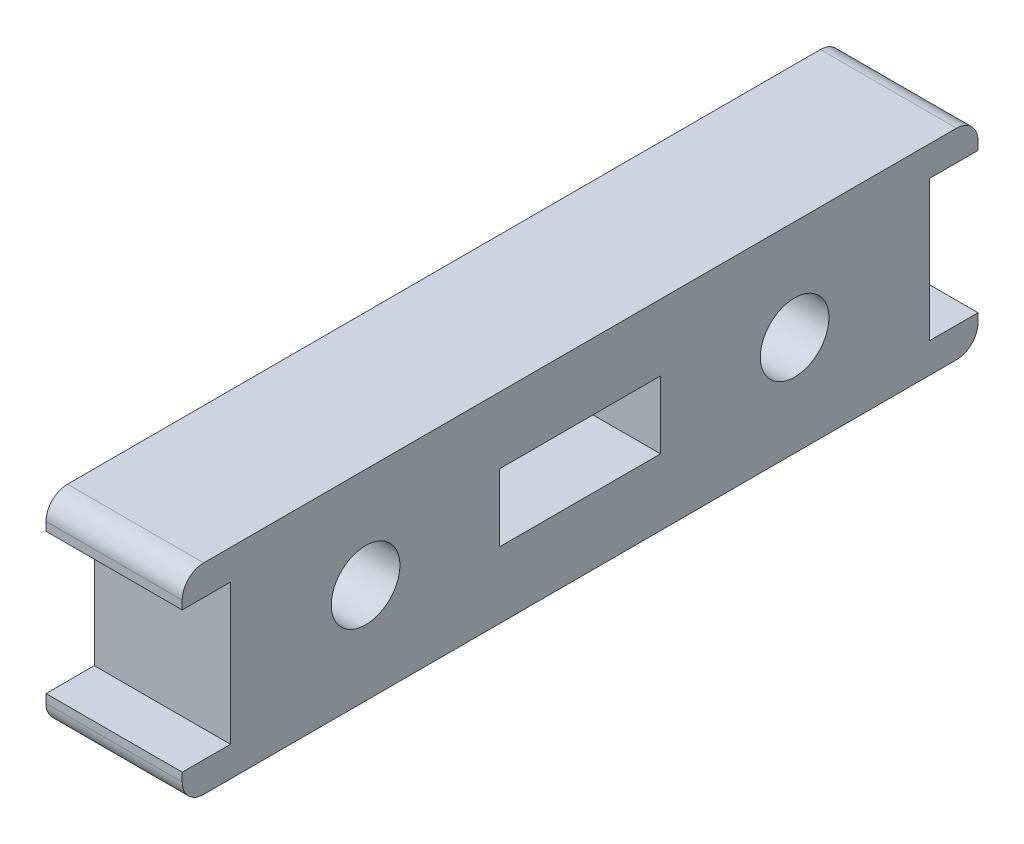
ISO-10303-21;
HEADER;
FILE_DESCRIPTION(('STEP AP214'),'2;1');
FILE_NAME('part.step','',(''),(''),'','','');
FILE_SCHEMA(('AUTOMOTIVE_DESIGN { 1 0 10303 214 1 1 1 1 }'));
ENDSEC;
DATA;
#1=APPLICATION_CONTEXT('core data for automotive mechanical design processes');
#2=APPLICATION_PROTOCOL_DEFINITION('international standard','automotive_design',2000,#1);
#3=PRODUCT_CONTEXT('',#1,'mechanical');
#4=PRODUCT('Part','Part','',(#3));
#5=PRODUCT_RELATED_PRODUCT_CATEGORY('part','',(#4));
#6=PRODUCT_DEFINITION_FORMATION('','',#4);
#7=PRODUCT_DEFINITION_CONTEXT('part definition',#1,'design');
#8=PRODUCT_DEFINITION('design','',#6,#7);
#9=PRODUCT_DEFINITION_SHAPE('','',#8);
#10=(LENGTH_UNIT() NAMED_UNIT(*) SI_UNIT(.MILLI.,.METRE.));
#11=(NAMED_UNIT(*) PLANE_ANGLE_UNIT() SI_UNIT($,.RADIAN.));
#12=(NAMED_UNIT(*) SI_UNIT($,.STERADIAN.) SOLID_ANGLE_UNIT());
#13=UNCERTAINTY_MEASURE_WITH_UNIT(LENGTH_MEASURE(1.E-05),#10,'distance_accuracy_value','');
#14=(GEOMETRIC_REPRESENTATION_CONTEXT(3) GLOBAL_UNCERTAINTY_ASSIGNED_CONTEXT((#13)) GLOBAL_UNIT_ASSIGNED_CONTEXT((#10,
#11,#12)) REPRESENTATION_CONTEXT('',''));
#15=CARTESIAN_POINT('',(0.,0.,0.));
#16=DIRECTION('',(0.,0.,1.));
#17=DIRECTION('',(1.,0.,0.));
#18=AXIS2_PLACEMENT_3D('',#15,#16,#17);
#19=CARTESIAN_POINT('',(0.,-9.35000000000016,-37.1));
#20=DIRECTION('',(0.,0.,-1.));
#21=DIRECTION('',(-1.,0.,0.));
#22=AXIS2_PLACEMENT_3D('',#19,#20,#21);
#23=PLANE('',#22);
#24=DIRECTION('',(0.,1.,0.));
#25=VECTOR('',#24,1.);
#26=CARTESIAN_POINT('',(6.35000000000001,-9.35000000000016,-37.1));
#27=LINE('',#26,#25);
#28=CARTESIAN_POINT('',(6.35000000000001,-8.35000000000017,-37.1));
#29=VERTEX_POINT('',#28);
#30=CARTESIAN_POINT('',(6.35000000000001,-7.95000000000003,-37.1));
#31=VERTEX_POINT('',#30);
#32=EDGE_CURVE('E205',#29,#31,#27,.T.);
#33=ORIENTED_EDGE('',*,*,#32,.F.);
#34=DIRECTION('',(1.,0.,0.));
#35=VECTOR('',#34,1.);
#36=CARTESIAN_POINT('',(0.,-8.35000000000017,-37.1));
#37=LINE('',#36,#35);
#38=CARTESIAN_POINT('',(0.,-8.35000000000017,-37.1));
#39=VERTEX_POINT('',#38);
#40=EDGE_CURVE('E11',#29,#39,#37,.F.);
#41=ORIENTED_EDGE('',*,*,#40,.T.);
#42=DIRECTION('',(0.,1.,0.));
#43=VECTOR('',#42,1.);
#44=CARTESIAN_POINT('',(0.,-9.35000000000016,-37.1));
#45=LINE('',#44,#43);
#46=CARTESIAN_POINT('',(0.,-7.95000000000003,-37.1));
#47=VERTEX_POINT('',#46);
#48=EDGE_CURVE('E209',#39,#47,#45,.T.);
#49=ORIENTED_EDGE('',*,*,#48,.T.);
#50=DIRECTION('',(1.,0.,0.));
#51=VECTOR('',#50,1.);
#52=CARTESIAN_POINT('',(0.,-7.95000000000003,-37.1));
#53=LINE('',#52,#51);
#54=EDGE_CURVE('E244',#47,#31,#53,.T.);
#55=ORIENTED_EDGE('',*,*,#54,.T.);
#56=EDGE_LOOP('',(#33,#41,#49,#55));
#57=FACE_BOUND('',#56,.T.);
#58=ADVANCED_FACE('F33',(#57),#23,.T.);
#59=CARTESIAN_POINT('',(0.,-9.35000000000027,0.));
#60=DIRECTION('',(0.,-1.,0.));
#61=DIRECTION('',(0.,0.,-1.));
#62=AXIS2_PLACEMENT_3D('',#59,#60,#61);
#63=PLANE('',#62);
#64=DIRECTION('',(0.,0.,-1.));
#65=VECTOR('',#64,1.);
#66=CARTESIAN_POINT('',(6.35000000000001,-9.35000000000027,0.));
#67=LINE('',#66,#65);
#68=CARTESIAN_POINT('',(6.35000000000001,-9.35000000000027,-1.00000000000002));
#69=VERTEX_POINT('',#68);
#70=CARTESIAN_POINT('',(6.35000000000001,-9.35000000000016,-36.1));
#71=VERTEX_POINT('',#70);
#72=EDGE_CURVE('E212',#69,#71,#67,.T.);
#73=ORIENTED_EDGE('',*,*,#72,.F.);
#74=DIRECTION('',(1.,0.,0.));
#75=VECTOR('',#74,1.);
#76=CARTESIAN_POINT('',(0.,-9.35000000000027,-1.00000000000002));
#77=LINE('',#76,#75);
#78=CARTESIAN_POINT('',(0.,-9.35000000000027,-1.00000000000002));
#79=VERTEX_POINT('',#78);
#80=EDGE_CURVE('E41',#69,#79,#77,.F.);
#81=ORIENTED_EDGE('',*,*,#80,.T.);
#82=DIRECTION('',(0.,0.,-1.));
#83=VECTOR('',#82,1.);
#84=CARTESIAN_POINT('',(0.,-9.35000000000027,0.));
#85=LINE('',#84,#83);
#86=CARTESIAN_POINT('',(0.,-9.35000000000016,-36.1));
#87=VERTEX_POINT('',#86);
#88=EDGE_CURVE('E241',#79,#87,#85,.T.);
#89=ORIENTED_EDGE('',*,*,#88,.T.);
#90=DIRECTION('',(1.,0.,0.));
#91=VECTOR('',#90,1.);
#92=CARTESIAN_POINT('',(0.,-9.35000000000016,-36.1));
#93=LINE('',#92,#91);
#94=EDGE_CURVE('E323',#87,#71,#93,.T.);
#95=ORIENTED_EDGE('',*,*,#94,.T.);
#96=EDGE_LOOP('',(#73,#81,#89,#95));
#97=FACE_BOUND('',#96,.T.);
#98=ADVANCED_FACE('F329',(#97),#63,.T.);
#99=CARTESIAN_POINT('',(0.,-7.95000000000009,0.));
#100=DIRECTION('',(0.,0.,1.));
#101=DIRECTION('',(0.,-1.,0.));
#102=AXIS2_PLACEMENT_3D('',#99,#100,#101);
#103=PLANE('',#102);
#104=DIRECTION('',(0.,-1.,0.));
#105=VECTOR('',#104,1.);
#106=CARTESIAN_POINT('',(0.,-7.95000000000009,0.));
#107=LINE('',#106,#105);
#108=CARTESIAN_POINT('',(0.,-7.95000000000009,0.));
#109=VERTEX_POINT('',#108);
#110=CARTESIAN_POINT('',(0.,-8.35000000000028,0.));
#111=VERTEX_POINT('',#110);
#112=EDGE_CURVE('E238',#109,#111,#107,.T.);
#113=ORIENTED_EDGE('',*,*,#112,.T.);
#114=DIRECTION('',(1.,0.,0.));
#115=VECTOR('',#114,1.);
#116=CARTESIAN_POINT('',(0.,-8.35000000000028,0.));
#117=LINE('',#116,#115);
#118=CARTESIAN_POINT('',(6.35000000000001,-8.35000000000028,0.));
#119=VERTEX_POINT('',#118);
#120=EDGE_CURVE('E320',#111,#119,#117,.T.);
#121=ORIENTED_EDGE('',*,*,#120,.T.);
#122=DIRECTION('',(0.,-1.,0.));
#123=VECTOR('',#122,1.);
#124=CARTESIAN_POINT('',(6.35000000000001,-7.95000000000009,0.));
#125=LINE('',#124,#123);
#126=CARTESIAN_POINT('',(6.35000000000001,-7.95000000000009,0.));
#127=VERTEX_POINT('',#126);
#128=EDGE_CURVE('E272',#127,#119,#125,.T.);
#129=ORIENTED_EDGE('',*,*,#128,.F.);
#130=DIRECTION('',(1.,0.,0.));
#131=VECTOR('',#130,1.);
#132=CARTESIAN_POINT('',(0.,-7.95000000000009,0.));
#133=LINE('',#132,#131);
#134=EDGE_CURVE('E277',#109,#127,#133,.T.);
#135=ORIENTED_EDGE('',*,*,#134,.F.);
#136=EDGE_LOOP('',(#113,#121,#129,#135));
#137=FACE_BOUND('',#136,.T.);
#138=ADVANCED_FACE('F343',(#137),#103,.T.);
#139=CARTESIAN_POINT('',(0.,-7.95000000000008,-2.24999999999999));
#140=DIRECTION('',(0.,1.,0.));
#141=DIRECTION('',(0.,0.,1.));
#142=AXIS2_PLACEMENT_3D('',#139,#140,#141);
#143=PLANE('',#142);
#144=DIRECTION('',(0.,0.,1.));
#145=VECTOR('',#144,1.);
#146=CARTESIAN_POINT('',(6.35000000000001,-7.95000000000008,-2.24999999999999));
#147=LINE('',#146,#145);
#148=CARTESIAN_POINT('',(6.35000000000001,-7.95000000000008,-2.24999999999999));
#149=VERTEX_POINT('',#148);
#150=EDGE_CURVE('E269',#149,#127,#147,.T.);
#151=ORIENTED_EDGE('',*,*,#150,.F.);
#152=DIRECTION('',(1.,0.,0.));
#153=VECTOR('',#152,1.);
#154=CARTESIAN_POINT('',(0.,-7.95000000000008,-2.24999999999999));
#155=LINE('',#154,#153);
#156=CARTESIAN_POINT('',(0.,-7.95000000000008,-2.24999999999999));
#157=VERTEX_POINT('',#156);
#158=EDGE_CURVE('E280',#157,#149,#155,.T.);
#159=ORIENTED_EDGE('',*,*,#158,.F.);
#160=DIRECTION('',(0.,0.,1.));
#161=VECTOR('',#160,1.);
#162=CARTESIAN_POINT('',(0.,-7.95000000000008,-2.24999999999999));
#163=LINE('',#162,#161);
#164=EDGE_CURVE('E235',#157,#109,#163,.T.);
#165=ORIENTED_EDGE('',*,*,#164,.T.);
#166=ORIENTED_EDGE('',*,*,#134,.T.);
#167=EDGE_LOOP('',(#151,#159,#165,#166));
#168=FACE_BOUND('',#167,.T.);
#169=ADVANCED_FACE('F347',(#168),#143,.T.);
#170=CARTESIAN_POINT('',(0.,-1.40000000000018,-2.24999999999997));
#171=DIRECTION('',(0.,0.,1.));
#172=DIRECTION('',(0.,-1.,0.));
#173=AXIS2_PLACEMENT_3D('',#170,#171,#172);
#174=PLANE('',#173);
#175=DIRECTION('',(0.,-1.,0.));
#176=VECTOR('',#175,1.);
#177=CARTESIAN_POINT('',(6.35000000000001,-1.40000000000018,-2.24999999999997));
#178=LINE('',#177,#176);
#179=CARTESIAN_POINT('',(6.35000000000001,-1.40000000000018,-2.24999999999997));
#180=VERTEX_POINT('',#179);
#181=EDGE_CURVE('E266',#180,#149,#178,.T.);
#182=ORIENTED_EDGE('',*,*,#181,.F.);
#183=DIRECTION('',(1.,0.,0.));
#184=VECTOR('',#183,1.);
#185=CARTESIAN_POINT('',(0.,-1.40000000000018,-2.24999999999997));
#186=LINE('',#185,#184);
#187=CARTESIAN_POINT('',(0.,-1.40000000000018,-2.24999999999997));
#188=VERTEX_POINT('',#187);
#189=EDGE_CURVE('E282',#188,#180,#186,.T.);
#190=ORIENTED_EDGE('',*,*,#189,.F.);
#191=DIRECTION('',(0.,-1.,0.));
#192=VECTOR('',#191,1.);
#193=CARTESIAN_POINT('',(0.,-1.40000000000018,-2.24999999999997));
#194=LINE('',#193,#192);
#195=EDGE_CURVE('E232',#188,#157,#194,.T.);
#196=ORIENTED_EDGE('',*,*,#195,.T.);
#197=ORIENTED_EDGE('',*,*,#158,.T.);
#198=EDGE_LOOP('',(#182,#190,#196,#197));
#199=FACE_BOUND('',#198,.T.);
#200=ADVANCED_FACE('F352',(#199),#174,.T.);
#201=CARTESIAN_POINT('',(0.,-1.40000000000019,0.));
#202=DIRECTION('',(0.,-1.,0.));
#203=DIRECTION('',(0.,0.,-1.));
#204=AXIS2_PLACEMENT_3D('',#201,#202,#203);
#205=PLANE('',#204);
#206=DIRECTION('',(0.,0.,-1.));
#207=VECTOR('',#206,1.);
#208=CARTESIAN_POINT('',(6.35000000000001,-1.40000000000019,0.));
#209=LINE('',#208,#207);
#210=CARTESIAN_POINT('',(6.35000000000001,-1.40000000000019,0.));
#211=VERTEX_POINT('',#210);
#212=EDGE_CURVE('E263',#211,#180,#209,.T.);
#213=ORIENTED_EDGE('',*,*,#212,.F.);
#214=DIRECTION('',(1.,0.,0.));
#215=VECTOR('',#214,1.);
#216=CARTESIAN_POINT('',(0.,-1.40000000000019,0.));
#217=LINE('',#216,#215);
#218=CARTESIAN_POINT('',(0.,-1.40000000000019,0.));
#219=VERTEX_POINT('',#218);
#220=EDGE_CURVE('E284',#219,#211,#217,.T.);
#221=ORIENTED_EDGE('',*,*,#220,.F.);
#222=DIRECTION('',(0.,0.,-1.));
#223=VECTOR('',#222,1.);
#224=CARTESIAN_POINT('',(0.,-1.40000000000019,0.));
#225=LINE('',#224,#223);
#226=EDGE_CURVE('E229',#219,#188,#225,.T.);
#227=ORIENTED_EDGE('',*,*,#226,.T.);
#228=ORIENTED_EDGE('',*,*,#189,.T.);
#229=EDGE_LOOP('',(#213,#221,#227,#228));
#230=FACE_BOUND('',#229,.T.);
#231=ADVANCED_FACE('F355',(#230),#205,.T.);
#232=CARTESIAN_POINT('',(0.,0.,0.));
#233=DIRECTION('',(0.,0.,1.));
#234=DIRECTION('',(0.,-1.,0.));
#235=AXIS2_PLACEMENT_3D('',#232,#233,#234);
#236=PLANE('',#235);
#237=DIRECTION('',(0.,-1.,0.));
#238=VECTOR('',#237,1.);
#239=CARTESIAN_POINT('',(6.35000000000001,0.,0.));
#240=LINE('',#239,#238);
#241=CARTESIAN_POINT('',(6.35000000000001,-0.999999999999997,0.));
#242=VERTEX_POINT('',#241);
#243=EDGE_CURVE('E261',#242,#211,#240,.T.);
#244=ORIENTED_EDGE('',*,*,#243,.F.);
#245=DIRECTION('',(1.,0.,0.));
#246=VECTOR('',#245,1.);
#247=CARTESIAN_POINT('',(0.,-0.999999999999997,0.));
#248=LINE('',#247,#246);
#249=CARTESIAN_POINT('',(0.,-0.999999999999997,0.));
#250=VERTEX_POINT('',#249);
#251=EDGE_CURVE('E318',#242,#250,#248,.F.);
#252=ORIENTED_EDGE('',*,*,#251,.T.);
#253=DIRECTION('',(0.,-1.,0.));
#254=VECTOR('',#253,1.);
#255=CARTESIAN_POINT('',(0.,0.,0.));
#256=LINE('',#255,#254);
#257=EDGE_CURVE('E227',#250,#219,#256,.T.);
#258=ORIENTED_EDGE('',*,*,#257,.T.);
#259=ORIENTED_EDGE('',*,*,#220,.T.);
#260=EDGE_LOOP('',(#244,#252,#258,#259));
#261=FACE_BOUND('',#260,.T.);
#262=ADVANCED_FACE('F513',(#261),#236,.T.);
#263=CARTESIAN_POINT('',(0.,0.,-37.1));
#264=DIRECTION('',(0.,1.,0.));
#265=DIRECTION('',(0.,0.,1.));
#266=AXIS2_PLACEMENT_3D('',#263,#264,#265);
#267=PLANE('',#266);
#268=DIRECTION('',(0.,0.,1.));
#269=VECTOR('',#268,1.);
#270=CARTESIAN_POINT('',(6.35000000000001,0.,-37.1));
#271=LINE('',#270,#269);
#272=CARTESIAN_POINT('',(6.35000000000001,0.,-36.1));
#273=VERTEX_POINT('',#272);
#274=CARTESIAN_POINT('',(6.35000000000001,0.,-0.999999999999994));
#275=VERTEX_POINT('',#274);
#276=EDGE_CURVE('E258',#273,#275,#271,.T.);
#277=ORIENTED_EDGE('',*,*,#276,.F.);
#278=DIRECTION('',(1.,0.,0.));
#279=VECTOR('',#278,1.);
#280=CARTESIAN_POINT('',(0.,0.,-36.1));
#281=LINE('',#280,#279);
#282=CARTESIAN_POINT('',(0.,0.,-36.1));
#283=VERTEX_POINT('',#282);
#284=EDGE_CURVE('E308',#273,#283,#281,.F.);
#285=ORIENTED_EDGE('',*,*,#284,.T.);
#286=DIRECTION('',(0.,0.,1.));
#287=VECTOR('',#286,1.);
#288=CARTESIAN_POINT('',(0.,0.,-37.1));
#289=LINE('',#288,#287);
#290=CARTESIAN_POINT('',(0.,0.,-0.999999999999994));
#291=VERTEX_POINT('',#290);
#292=EDGE_CURVE('E224',#283,#291,#289,.T.);
#293=ORIENTED_EDGE('',*,*,#292,.T.);
#294=DIRECTION('',(1.,0.,0.));
#295=VECTOR('',#294,1.);
#296=CARTESIAN_POINT('',(0.,0.,-0.999999999999994));
#297=LINE('',#296,#295);
#298=EDGE_CURVE('E305',#291,#275,#297,.T.);
#299=ORIENTED_EDGE('',*,*,#298,.T.);
#300=EDGE_LOOP('',(#277,#285,#293,#299));
#301=FACE_BOUND('',#300,.T.);
#302=ADVANCED_FACE('F366',(#301),#267,.T.);
#303=CARTESIAN_POINT('',(0.,-1.40000000000014,-37.1));
#304=DIRECTION('',(0.,0.,-1.));
#305=DIRECTION('',(0.,1.,0.));
#306=AXIS2_PLACEMENT_3D('',#303,#304,#305);
#307=PLANE('',#306);
#308=DIRECTION('',(0.,1.,0.));
#309=VECTOR('',#308,1.);
#310=CARTESIAN_POINT('',(0.,-1.40000000000014,-37.1));
#311=LINE('',#310,#309);
#312=CARTESIAN_POINT('',(0.,-1.40000000000014,-37.1));
#313=VERTEX_POINT('',#312);
#314=CARTESIAN_POINT('',(0.,-0.999999999999989,-37.1));
#315=VERTEX_POINT('',#314);
#316=EDGE_CURVE('E221',#313,#315,#311,.T.);
#317=ORIENTED_EDGE('',*,*,#316,.T.);
#318=DIRECTION('',(1.,0.,0.));
#319=VECTOR('',#318,1.);
#320=CARTESIAN_POINT('',(0.,-0.999999999999989,-37.1));
#321=LINE('',#320,#319);
#322=CARTESIAN_POINT('',(6.35000000000001,-0.999999999999989,-37.1));
#323=VERTEX_POINT('',#322);
#324=EDGE_CURVE('E279',#315,#323,#321,.T.);
#325=ORIENTED_EDGE('',*,*,#324,.T.);
#326=DIRECTION('',(0.,1.,0.));
#327=VECTOR('',#326,1.);
#328=CARTESIAN_POINT('',(6.35000000000001,-1.40000000000014,-37.1));
#329=LINE('',#328,#327);
#330=CARTESIAN_POINT('',(6.35000000000001,-1.40000000000014,-37.1));
#331=VERTEX_POINT('',#330);
#332=EDGE_CURVE('E255',#331,#323,#329,.T.);
#333=ORIENTED_EDGE('',*,*,#332,.F.);
#334=DIRECTION('',(1.,0.,0.));
#335=VECTOR('',#334,1.);
#336=CARTESIAN_POINT('',(0.,-1.40000000000014,-37.1));
#337=LINE('',#336,#335);
#338=EDGE_CURVE('E287',#313,#331,#337,.T.);
#339=ORIENTED_EDGE('',*,*,#338,.F.);
#340=EDGE_LOOP('',(#317,#325,#333,#339));
#341=FACE_BOUND('',#340,.T.);
#342=ADVANCED_FACE('F375',(#341),#307,.T.);
#343=CARTESIAN_POINT('',(0.,-1.40000000000013,-34.85));
#344=DIRECTION('',(0.,-1.,0.));
#345=DIRECTION('',(0.,0.,-1.));
#346=AXIS2_PLACEMENT_3D('',#343,#344,#345);
#347=PLANE('',#346);
#348=DIRECTION('',(0.,0.,-1.));
#349=VECTOR('',#348,1.);
#350=CARTESIAN_POINT('',(6.35000000000001,-1.40000000000013,-34.85));
#351=LINE('',#350,#349);
#352=CARTESIAN_POINT('',(6.35000000000001,-1.40000000000013,-34.85));
#353=VERTEX_POINT('',#352);
#354=EDGE_CURVE('E252',#353,#331,#351,.T.);
#355=ORIENTED_EDGE('',*,*,#354,.F.);
#356=DIRECTION('',(1.,0.,0.));
#357=VECTOR('',#356,1.);
#358=CARTESIAN_POINT('',(0.,-1.40000000000013,-34.85));
#359=LINE('',#358,#357);
#360=CARTESIAN_POINT('',(0.,-1.40000000000013,-34.85));
#361=VERTEX_POINT('',#360);
#362=EDGE_CURVE('E289',#361,#353,#359,.T.);
#363=ORIENTED_EDGE('',*,*,#362,.F.);
#364=DIRECTION('',(0.,0.,-1.));
#365=VECTOR('',#364,1.);
#366=CARTESIAN_POINT('',(0.,-1.40000000000013,-34.85));
#367=LINE('',#366,#365);
#368=EDGE_CURVE('E218',#361,#313,#367,.T.);
#369=ORIENTED_EDGE('',*,*,#368,.T.);
#370=ORIENTED_EDGE('',*,*,#338,.T.);
#371=EDGE_LOOP('',(#355,#363,#369,#370));
#372=FACE_BOUND('',#371,.T.);
#373=ADVANCED_FACE('F381',(#372),#347,.T.);
#374=CARTESIAN_POINT('',(0.,-7.95000000000003,-34.85));
#375=DIRECTION('',(0.,0.,-1.));
#376=DIRECTION('',(0.,1.,0.));
#377=AXIS2_PLACEMENT_3D('',#374,#375,#376);
#378=PLANE('',#377);
#379=DIRECTION('',(0.,1.,0.));
#380=VECTOR('',#379,1.);
#381=CARTESIAN_POINT('',(6.35000000000001,-7.95000000000003,-34.85));
#382=LINE('',#381,#380);
#383=CARTESIAN_POINT('',(6.35000000000001,-7.95000000000003,-34.85));
#384=VERTEX_POINT('',#383);
#385=EDGE_CURVE('E249',#384,#353,#382,.T.);
#386=ORIENTED_EDGE('',*,*,#385,.F.);
#387=DIRECTION('',(1.,0.,0.));
#388=VECTOR('',#387,1.);
#389=CARTESIAN_POINT('',(0.,-7.95000000000003,-34.85));
#390=LINE('',#389,#388);
#391=CARTESIAN_POINT('',(0.,-7.95000000000003,-34.85));
#392=VERTEX_POINT('',#391);
#393=EDGE_CURVE('E291',#392,#384,#390,.T.);
#394=ORIENTED_EDGE('',*,*,#393,.F.);
#395=DIRECTION('',(0.,1.,0.));
#396=VECTOR('',#395,1.);
#397=CARTESIAN_POINT('',(0.,-7.95000000000003,-34.85));
#398=LINE('',#397,#396);
#399=EDGE_CURVE('E215',#392,#361,#398,.T.);
#400=ORIENTED_EDGE('',*,*,#399,.T.);
#401=ORIENTED_EDGE('',*,*,#362,.T.);
#402=EDGE_LOOP('',(#386,#394,#400,#401));
#403=FACE_BOUND('',#402,.T.);
#404=ADVANCED_FACE('F384',(#403),#378,.T.);
#405=CARTESIAN_POINT('',(0.,-7.95000000000003,-37.1));
#406=DIRECTION('',(0.,1.,0.));
#407=DIRECTION('',(0.,0.,1.));
#408=AXIS2_PLACEMENT_3D('',#405,#406,#407);
#409=PLANE('',#408);
#410=DIRECTION('',(0.,0.,1.));
#411=VECTOR('',#410,1.);
#412=CARTESIAN_POINT('',(6.35000000000001,-7.95000000000003,-37.1));
#413=LINE('',#412,#411);
#414=EDGE_CURVE('E246',#31,#384,#413,.T.);
#415=ORIENTED_EDGE('',*,*,#414,.F.);
#416=ORIENTED_EDGE('',*,*,#54,.F.);
#417=DIRECTION('',(0.,0.,1.));
#418=VECTOR('',#417,1.);
#419=CARTESIAN_POINT('',(0.,-7.95000000000003,-37.1));
#420=LINE('',#419,#418);
#421=EDGE_CURVE('E211',#47,#392,#420,.T.);
#422=ORIENTED_EDGE('',*,*,#421,.T.);
#423=ORIENTED_EDGE('',*,*,#393,.T.);
#424=EDGE_LOOP('',(#415,#416,#422,#423));
#425=FACE_BOUND('',#424,.T.);
#426=ADVANCED_FACE('F389',(#425),#409,.T.);
#427=CARTESIAN_POINT('',(0.,0.,0.));
#428=DIRECTION('',(1.,0.,0.));
#429=DIRECTION('',(0.,0.,-1.));
#430=AXIS2_PLACEMENT_3D('',#427,#428,#429);
#431=PLANE('',#430);
#432=CARTESIAN_POINT('',(-1.72604985859692E-13,-4.67500000000015,-8.55));
#433=DIRECTION('',(1.,0.,0.));
#434=DIRECTION('',(0.,0.,-1.));
#435=AXIS2_PLACEMENT_3D('',#432,#433,#434);
#436=CIRCLE('',#435,1.59999999999998);
#437=CARTESIAN_POINT('',(-1.7137140472122E-13,-4.67500000000015,-10.15));
#438=VERTEX_POINT('',#437);
#439=EDGE_CURVE('E597',#438,#438,#436,.T.);
#440=ORIENTED_EDGE('',*,*,#439,.T.);
#441=EDGE_LOOP('',(#440));
#442=FACE_BOUND('',#441,.T.);
#443=CARTESIAN_POINT('',(-1.15359111152458E-13,-4.67500000000013,-28.55));
#444=DIRECTION('',(1.,0.,0.));
#445=DIRECTION('',(0.,0.,-1.));
#446=AXIS2_PLACEMENT_3D('',#443,#444,#445);
#447=CIRCLE('',#446,1.59999999999999);
#448=CARTESIAN_POINT('',(-1.14125530013985E-13,-4.67500000000013,-30.15));
#449=VERTEX_POINT('',#448);
#450=EDGE_CURVE('E193',#449,#449,#447,.T.);
#451=ORIENTED_EDGE('',*,*,#450,.T.);
#452=EDGE_LOOP('',(#451));
#453=FACE_BOUND('',#452,.T.);
#454=DIRECTION('',(0.,0.,-1.));
#455=VECTOR('',#454,1.);
#456=CARTESIAN_POINT('',(0.,-3.10000000000019,-14.8));
#457=LINE('',#456,#455);
#458=CARTESIAN_POINT('',(0.,-3.10000000000019,-14.8));
#459=VERTEX_POINT('',#458);
#460=CARTESIAN_POINT('',(0.,-3.10000000000017,-22.3));
#461=VERTEX_POINT('',#460);
#462=EDGE_CURVE('E199',#459,#461,#457,.T.);
#463=ORIENTED_EDGE('',*,*,#462,.F.);
#464=DIRECTION('',(0.,1.,0.));
#465=VECTOR('',#464,1.);
#466=CARTESIAN_POINT('',(0.,-6.25000000000018,-14.8));
#467=LINE('',#466,#465);
#468=CARTESIAN_POINT('',(0.,-6.25000000000018,-14.8));
#469=VERTEX_POINT('',#468);
#470=EDGE_CURVE('E48',#469,#459,#467,.T.);
#471=ORIENTED_EDGE('',*,*,#470,.F.);
#472=DIRECTION('',(0.,0.,1.));
#473=VECTOR('',#472,1.);
#474=CARTESIAN_POINT('',(0.,-6.25000000000017,-22.3));
#475=LINE('',#474,#473);
#476=CARTESIAN_POINT('',(0.,-6.25000000000017,-22.3));
#477=VERTEX_POINT('',#476);
#478=EDGE_CURVE('E187',#477,#469,#475,.T.);
#479=ORIENTED_EDGE('',*,*,#478,.F.);
#480=DIRECTION('',(0.,-1.,0.));
#481=VECTOR('',#480,1.);
#482=CARTESIAN_POINT('',(0.,-3.10000000000017,-22.3));
#483=LINE('',#482,#481);
#484=EDGE_CURVE('E190',#461,#477,#483,.T.);
#485=ORIENTED_EDGE('',*,*,#484,.F.);
#486=EDGE_LOOP('',(#463,#471,#479,#485));
#487=FACE_BOUND('',#486,.T.);
#488=ORIENTED_EDGE('',*,*,#292,.F.);
#489=CARTESIAN_POINT('',(0.,-0.999999999999994,-36.1));
#490=DIRECTION('',(1.,0.,0.));
#491=DIRECTION('',(0.,0.,-1.));
#492=AXIS2_PLACEMENT_3D('',#489,#490,#491);
#493=CIRCLE('',#492,0.999999999999994);
#494=EDGE_CURVE('E316',#283,#315,#493,.F.);
#495=ORIENTED_EDGE('',*,*,#494,.T.);
#496=ORIENTED_EDGE('',*,*,#316,.F.);
#497=ORIENTED_EDGE('',*,*,#368,.F.);
#498=ORIENTED_EDGE('',*,*,#399,.F.);
#499=ORIENTED_EDGE('',*,*,#421,.F.);
#500=ORIENTED_EDGE('',*,*,#48,.F.);
#501=CARTESIAN_POINT('',(0.,-8.35000000000017,-36.1));
#502=DIRECTION('',(1.,0.,0.));
#503=DIRECTION('',(0.,0.,-1.));
#504=AXIS2_PLACEMENT_3D('',#501,#502,#503);
#505=CIRCLE('',#504,0.999999999999994);
#506=EDGE_CURVE('E310',#39,#87,#505,.F.);
#507=ORIENTED_EDGE('',*,*,#506,.T.);
#508=ORIENTED_EDGE('',*,*,#88,.F.);
#509=CARTESIAN_POINT('',(0.,-8.35000000000027,-1.00000000000002));
#510=DIRECTION('',(1.,0.,0.));
#511=DIRECTION('',(0.,0.,-1.));
#512=AXIS2_PLACEMENT_3D('',#509,#510,#511);
#513=CIRCLE('',#512,0.999999999999994);
#514=EDGE_CURVE('E312',#79,#111,#513,.F.);
#515=ORIENTED_EDGE('',*,*,#514,.T.);
#516=ORIENTED_EDGE('',*,*,#112,.F.);
#517=ORIENTED_EDGE('',*,*,#164,.F.);
#518=ORIENTED_EDGE('',*,*,#195,.F.);
#519=ORIENTED_EDGE('',*,*,#226,.F.);
#520=ORIENTED_EDGE('',*,*,#257,.F.);
#521=CARTESIAN_POINT('',(0.,-0.999999999999994,-0.999999999999994));
#522=DIRECTION('',(1.,0.,0.));
#523=DIRECTION('',(0.,0.,-1.));
#524=AXIS2_PLACEMENT_3D('',#521,#522,#523);
#525=CIRCLE('',#524,0.999999999999994);
#526=EDGE_CURVE('E314',#250,#291,#525,.F.);
#527=ORIENTED_EDGE('',*,*,#526,.T.);
#528=EDGE_LOOP('',(#488,#495,#496,#497,#498,#499,#500,#507,#508,#515,#516,#517,#518,#519,#520,#527));
#529=FACE_BOUND('',#528,.T.);
#530=ADVANCED_FACE('F335',(#442,#453,#487,#529),#431,.F.);
#531=CARTESIAN_POINT('',(6.35000000000001,0.,0.));
#532=DIRECTION('',(1.,0.,0.));
#533=DIRECTION('',(0.,0.,-1.));
#534=AXIS2_PLACEMENT_3D('',#531,#532,#533);
#535=PLANE('',#534);
#536=CARTESIAN_POINT('',(6.34999999999998,-4.67500000000015,-8.54999999999999));
#537=DIRECTION('',(1.,0.,0.));
#538=DIRECTION('',(0.,0.,-1.));
#539=AXIS2_PLACEMENT_3D('',#536,#537,#538);
#540=CIRCLE('',#539,1.59999999999999);
#541=CARTESIAN_POINT('',(6.34999999999998,-4.67500000000015,-10.15));
#542=VERTEX_POINT('',#541);
#543=EDGE_CURVE('E600',#542,#542,#540,.T.);
#544=ORIENTED_EDGE('',*,*,#543,.F.);
#545=EDGE_LOOP('',(#544));
#546=FACE_BOUND('',#545,.T.);
#547=CARTESIAN_POINT('',(6.34999999999999,-4.67500000000013,-28.55));
#548=DIRECTION('',(1.,0.,0.));
#549=DIRECTION('',(0.,0.,-1.));
#550=AXIS2_PLACEMENT_3D('',#547,#548,#549);
#551=CIRCLE('',#550,1.59999999999999);
#552=CARTESIAN_POINT('',(6.34999999999999,-4.67500000000013,-30.15));
#553=VERTEX_POINT('',#552);
#554=EDGE_CURVE('E602',#553,#553,#551,.T.);
#555=ORIENTED_EDGE('',*,*,#554,.F.);
#556=EDGE_LOOP('',(#555));
#557=FACE_BOUND('',#556,.T.);
#558=DIRECTION('',(0.,1.,0.));
#559=VECTOR('',#558,1.);
#560=CARTESIAN_POINT('',(6.35000000000005,-6.25000000000024,-14.8));
#561=LINE('',#560,#559);
#562=CARTESIAN_POINT('',(6.35000000000005,-6.25000000000024,-14.8));
#563=VERTEX_POINT('',#562);
#564=CARTESIAN_POINT('',(6.35000000000007,-3.10000000000025,-14.8));
#565=VERTEX_POINT('',#564);
#566=EDGE_CURVE('E171',#563,#565,#561,.T.);
#567=ORIENTED_EDGE('',*,*,#566,.T.);
#568=DIRECTION('',(0.,0.,-1.));
#569=VECTOR('',#568,1.);
#570=CARTESIAN_POINT('',(6.35000000000007,-3.10000000000025,-14.8));
#571=LINE('',#570,#569);
#572=CARTESIAN_POINT('',(6.35000000000001,-3.10000000000023,-22.3));
#573=VERTEX_POINT('',#572);
#574=EDGE_CURVE('E180',#565,#573,#571,.T.);
#575=ORIENTED_EDGE('',*,*,#574,.T.);
#576=DIRECTION('',(0.,-1.,0.));
#577=VECTOR('',#576,1.);
#578=CARTESIAN_POINT('',(6.35000000000008,-3.10000000000023,-22.3));
#579=LINE('',#578,#577);
#580=CARTESIAN_POINT('',(6.35000000000005,-6.25000000000022,-22.3));
#581=VERTEX_POINT('',#580);
#582=EDGE_CURVE('E56',#573,#581,#579,.T.);
#583=ORIENTED_EDGE('',*,*,#582,.T.);
#584=DIRECTION('',(0.,0.,1.));
#585=VECTOR('',#584,1.);
#586=CARTESIAN_POINT('',(6.35000000000005,-6.25000000000022,-22.3));
#587=LINE('',#586,#585);
#588=EDGE_CURVE('E177',#581,#563,#587,.T.);
#589=ORIENTED_EDGE('',*,*,#588,.T.);
#590=EDGE_LOOP('',(#567,#575,#583,#589));
#591=FACE_BOUND('',#590,.T.);
#592=ORIENTED_EDGE('',*,*,#332,.T.);
#593=CARTESIAN_POINT('',(6.35000000000001,-0.999999999999994,-36.1));
#594=DIRECTION('',(1.,0.,0.));
#595=DIRECTION('',(0.,0.,-1.));
#596=AXIS2_PLACEMENT_3D('',#593,#594,#595);
#597=CIRCLE('',#596,0.999999999999994);
#598=EDGE_CURVE('E303',#323,#273,#597,.T.);
#599=ORIENTED_EDGE('',*,*,#598,.T.);
#600=ORIENTED_EDGE('',*,*,#276,.T.);
#601=CARTESIAN_POINT('',(6.35000000000001,-0.999999999999994,-0.999999999999994));
#602=DIRECTION('',(1.,0.,0.));
#603=DIRECTION('',(0.,0.,-1.));
#604=AXIS2_PLACEMENT_3D('',#601,#602,#603);
#605=CIRCLE('',#604,0.999999999999994);
#606=EDGE_CURVE('E301',#275,#242,#605,.T.);
#607=ORIENTED_EDGE('',*,*,#606,.T.);
#608=ORIENTED_EDGE('',*,*,#243,.T.);
#609=ORIENTED_EDGE('',*,*,#212,.T.);
#610=ORIENTED_EDGE('',*,*,#181,.T.);
#611=ORIENTED_EDGE('',*,*,#150,.T.);
#612=ORIENTED_EDGE('',*,*,#128,.T.);
#613=CARTESIAN_POINT('',(6.35000000000001,-8.35000000000027,-1.00000000000002));
#614=DIRECTION('',(1.,0.,0.));
#615=DIRECTION('',(0.,0.,-1.));
#616=AXIS2_PLACEMENT_3D('',#613,#614,#615);
#617=CIRCLE('',#616,0.999999999999994);
#618=EDGE_CURVE('E299',#119,#69,#617,.T.);
#619=ORIENTED_EDGE('',*,*,#618,.T.);
#620=ORIENTED_EDGE('',*,*,#72,.T.);
#621=CARTESIAN_POINT('',(6.35000000000001,-8.35000000000017,-36.1));
#622=DIRECTION('',(1.,0.,0.));
#623=DIRECTION('',(0.,0.,-1.));
#624=AXIS2_PLACEMENT_3D('',#621,#622,#623);
#625=CIRCLE('',#624,0.999999999999994);
#626=EDGE_CURVE('E297',#71,#29,#625,.T.);
#627=ORIENTED_EDGE('',*,*,#626,.T.);
#628=ORIENTED_EDGE('',*,*,#32,.T.);
#629=ORIENTED_EDGE('',*,*,#414,.T.);
#630=ORIENTED_EDGE('',*,*,#385,.T.);
#631=ORIENTED_EDGE('',*,*,#354,.T.);
#632=EDGE_LOOP('',(#592,#599,#600,#607,#608,#609,#610,#611,#612,#619,#620,#627,#628,#629,#630,#631));
#633=FACE_BOUND('',#632,.T.);
#634=ADVANCED_FACE('F184',(#546,#557,#591,#633),#535,.T.);
#635=CARTESIAN_POINT('',(0.,-0.999999999999994,-36.1));
#636=DIRECTION('',(1.,0.,0.));
#637=DIRECTION('',(0.,0.,-1.));
#638=AXIS2_PLACEMENT_3D('',#635,#636,#637);
#639=CYLINDRICAL_SURFACE('',#638,0.999999999999994);
#640=ORIENTED_EDGE('',*,*,#494,.F.);
#641=ORIENTED_EDGE('',*,*,#284,.F.);
#642=ORIENTED_EDGE('',*,*,#598,.F.);
#643=ORIENTED_EDGE('',*,*,#324,.F.);
#644=EDGE_LOOP('',(#640,#641,#642,#643));
#645=FACE_BOUND('',#644,.T.);
#646=ADVANCED_FACE('F373',(#645),#639,.T.);
#647=CARTESIAN_POINT('',(0.,-0.999999999999994,-0.999999999999994));
#648=DIRECTION('',(1.,0.,0.));
#649=DIRECTION('',(0.,0.,-1.));
#650=AXIS2_PLACEMENT_3D('',#647,#648,#649);
#651=CYLINDRICAL_SURFACE('',#650,0.999999999999994);
#652=ORIENTED_EDGE('',*,*,#526,.F.);
#653=ORIENTED_EDGE('',*,*,#251,.F.);
#654=ORIENTED_EDGE('',*,*,#606,.F.);
#655=ORIENTED_EDGE('',*,*,#298,.F.);
#656=EDGE_LOOP('',(#652,#653,#654,#655));
#657=FACE_BOUND('',#656,.T.);
#658=ADVANCED_FACE('F363',(#657),#651,.T.);
#659=CARTESIAN_POINT('',(0.,-8.35000000000027,-1.00000000000002));
#660=DIRECTION('',(1.,0.,0.));
#661=DIRECTION('',(0.,0.,-1.));
#662=AXIS2_PLACEMENT_3D('',#659,#660,#661);
#663=CYLINDRICAL_SURFACE('',#662,0.999999999999994);
#664=ORIENTED_EDGE('',*,*,#514,.F.);
#665=ORIENTED_EDGE('',*,*,#80,.F.);
#666=ORIENTED_EDGE('',*,*,#618,.F.);
#667=ORIENTED_EDGE('',*,*,#120,.F.);
#668=EDGE_LOOP('',(#664,#665,#666,#667));
#669=FACE_BOUND('',#668,.T.);
#670=ADVANCED_FACE('F340',(#669),#663,.T.);
#671=CARTESIAN_POINT('',(0.,-8.35000000000017,-36.1));
#672=DIRECTION('',(1.,0.,0.));
#673=DIRECTION('',(0.,0.,-1.));
#674=AXIS2_PLACEMENT_3D('',#671,#672,#673);
#675=CYLINDRICAL_SURFACE('',#674,0.999999999999994);
#676=ORIENTED_EDGE('',*,*,#506,.F.);
#677=ORIENTED_EDGE('',*,*,#40,.F.);
#678=ORIENTED_EDGE('',*,*,#626,.F.);
#679=ORIENTED_EDGE('',*,*,#94,.F.);
#680=EDGE_LOOP('',(#676,#677,#678,#679));
#681=FACE_BOUND('',#680,.T.);
#682=ADVANCED_FACE('F35',(#681),#675,.T.);
#683=CARTESIAN_POINT('',(6.35000000000005,-6.25000000000024,-14.8));
#684=DIRECTION('',(0.,0.,1.));
#685=DIRECTION('',(0.,-1.,0.));
#686=AXIS2_PLACEMENT_3D('',#683,#684,#685);
#687=PLANE('',#686);
#688=ORIENTED_EDGE('',*,*,#470,.T.);
#689=DIRECTION('',(-1.,0.,0.));
#690=VECTOR('',#689,1.);
#691=CARTESIAN_POINT('',(6.35000000000007,-3.10000000000025,-14.8));
#692=LINE('',#691,#690);
#693=EDGE_CURVE('E167',#565,#459,#692,.T.);
#694=ORIENTED_EDGE('',*,*,#693,.F.);
#695=ORIENTED_EDGE('',*,*,#566,.F.);
#696=DIRECTION('',(-1.,0.,0.));
#697=VECTOR('',#696,1.);
#698=CARTESIAN_POINT('',(6.35000000000005,-6.25000000000024,-14.8));
#699=LINE('',#698,#697);
#700=EDGE_CURVE('E203',#563,#469,#699,.T.);
#701=ORIENTED_EDGE('',*,*,#700,.T.);
#702=EDGE_LOOP('',(#688,#694,#695,#701));
#703=FACE_BOUND('',#702,.T.);
#704=ADVANCED_FACE('F169',(#703),#687,.F.);
#705=CARTESIAN_POINT('',(6.35000000000005,-6.25000000000022,-22.3));
#706=DIRECTION('',(0.,-1.,0.));
#707=DIRECTION('',(1.,0.,0.));
#708=AXIS2_PLACEMENT_3D('',#705,#706,#707);
#709=PLANE('',#708);
#710=ORIENTED_EDGE('',*,*,#478,.T.);
#711=ORIENTED_EDGE('',*,*,#700,.F.);
#712=ORIENTED_EDGE('',*,*,#588,.F.);
#713=DIRECTION('',(-1.,0.,0.));
#714=VECTOR('',#713,1.);
#715=CARTESIAN_POINT('',(6.35000000000005,-6.25000000000022,-22.3));
#716=LINE('',#715,#714);
#717=EDGE_CURVE('E206',#581,#477,#716,.T.);
#718=ORIENTED_EDGE('',*,*,#717,.T.);
#719=EDGE_LOOP('',(#710,#711,#712,#718));
#720=FACE_BOUND('',#719,.T.);
#721=ADVANCED_FACE('F399',(#720),#709,.F.);
#722=CARTESIAN_POINT('',(6.35000000000008,-3.10000000000023,-22.3));
#723=DIRECTION('',(0.,0.,-1.));
#724=DIRECTION('',(0.,1.,0.));
#725=AXIS2_PLACEMENT_3D('',#722,#723,#724);
#726=PLANE('',#725);
#727=ORIENTED_EDGE('',*,*,#484,.T.);
#728=ORIENTED_EDGE('',*,*,#717,.F.);
#729=ORIENTED_EDGE('',*,*,#582,.F.);
#730=DIRECTION('',(-1.,0.,0.));
#731=VECTOR('',#730,1.);
#732=CARTESIAN_POINT('',(6.35000000000008,-3.10000000000023,-22.3));
#733=LINE('',#732,#731);
#734=EDGE_CURVE('E176',#573,#461,#733,.T.);
#735=ORIENTED_EDGE('',*,*,#734,.T.);
#736=EDGE_LOOP('',(#727,#728,#729,#735));
#737=FACE_BOUND('',#736,.T.);
#738=ADVANCED_FACE('F441',(#737),#726,.F.);
#739=CARTESIAN_POINT('',(6.35000000000007,-3.10000000000025,-14.8));
#740=DIRECTION('',(0.,1.,0.));
#741=DIRECTION('',(-1.,0.,0.));
#742=AXIS2_PLACEMENT_3D('',#739,#740,#741);
#743=PLANE('',#742);
#744=ORIENTED_EDGE('',*,*,#462,.T.);
#745=ORIENTED_EDGE('',*,*,#734,.F.);
#746=ORIENTED_EDGE('',*,*,#574,.F.);
#747=ORIENTED_EDGE('',*,*,#693,.T.);
#748=EDGE_LOOP('',(#744,#745,#746,#747));
#749=FACE_BOUND('',#748,.T.);
#750=ADVANCED_FACE('F181',(#749),#743,.F.);
#751=CARTESIAN_POINT('',(6.34999999999999,-4.67500000000013,-28.55));
#752=DIRECTION('',(1.,0.,0.));
#753=DIRECTION('',(0.,0.,-1.));
#754=AXIS2_PLACEMENT_3D('',#751,#752,#753);
#755=CYLINDRICAL_SURFACE('',#754,1.59999999999999);
#756=ORIENTED_EDGE('',*,*,#450,.F.);
#757=EDGE_LOOP('',(#756));
#758=FACE_BOUND('',#757,.T.);
#759=ORIENTED_EDGE('',*,*,#554,.T.);
#760=EDGE_LOOP('',(#759));
#761=FACE_BOUND('',#760,.T.);
#762=ADVANCED_FACE('F459',(#758,#761),#755,.F.);
#763=CARTESIAN_POINT('',(6.34999999999997,-4.67500000000015,-8.54999999999999));
#764=DIRECTION('',(1.,0.,0.));
#765=DIRECTION('',(0.,0.,-1.));
#766=AXIS2_PLACEMENT_3D('',#763,#764,#765);
#767=CYLINDRICAL_SURFACE('',#766,1.59999999999998);
#768=ORIENTED_EDGE('',*,*,#439,.F.);
#769=EDGE_LOOP('',(#768));
#770=FACE_BOUND('',#769,.T.);
#771=ORIENTED_EDGE('',*,*,#543,.T.);
#772=EDGE_LOOP('',(#771));
#773=FACE_BOUND('',#772,.T.);
#774=ADVANCED_FACE('F468',(#770,#773),#767,.F.);
#775=CLOSED_SHELL('',(#58,#98,#138,#169,#200,#231,#262,#302,#342,#373,#404,#426,#530,#634,#646,
#658,#670,#682,#704,#721,#738,#750,#762,#774));
#776=MANIFOLD_SOLID_BREP('B2',#775);
#777=ADVANCED_BREP_SHAPE_REPRESENTATION('',(#18,#776),#14);
#778=SHAPE_DEFINITION_REPRESENTATION(#9,#777);
ENDSEC;
END-ISO-10303-21;
